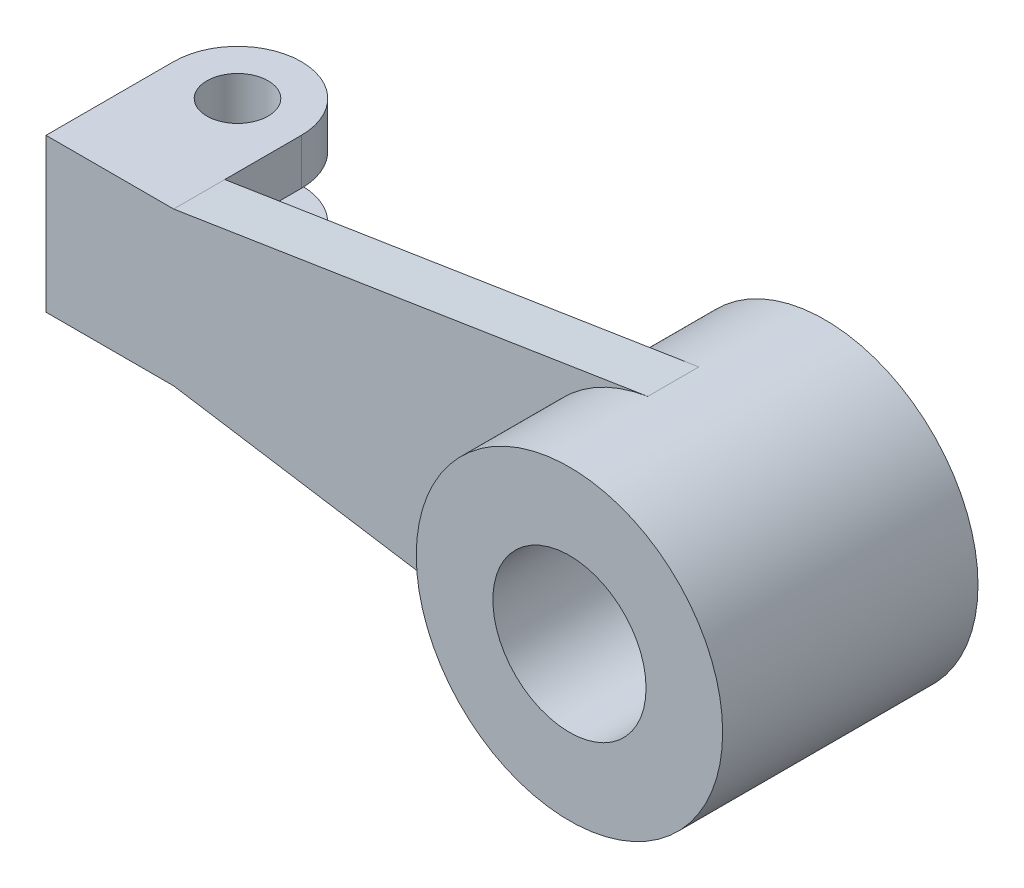
ISO-10303-21;
HEADER;
FILE_DESCRIPTION(('STEP AP214'),'2;1');
FILE_NAME('part.step','',(''),(''),'','','');
FILE_SCHEMA(('AUTOMOTIVE_DESIGN { 1 0 10303 214 1 1 1 1 }'));
ENDSEC;
DATA;
#1=APPLICATION_CONTEXT('core data for automotive mechanical design processes');
#2=APPLICATION_PROTOCOL_DEFINITION('international standard','automotive_design',2000,#1);
#3=PRODUCT_CONTEXT('',#1,'mechanical');
#4=PRODUCT('Part','Part','',(#3));
#5=PRODUCT_RELATED_PRODUCT_CATEGORY('part','',(#4));
#6=PRODUCT_DEFINITION_FORMATION('','',#4);
#7=PRODUCT_DEFINITION_CONTEXT('part definition',#1,'design');
#8=PRODUCT_DEFINITION('design','',#6,#7);
#9=PRODUCT_DEFINITION_SHAPE('','',#8);
#10=(LENGTH_UNIT() NAMED_UNIT(*) SI_UNIT(.MILLI.,.METRE.));
#11=(NAMED_UNIT(*) PLANE_ANGLE_UNIT() SI_UNIT($,.RADIAN.));
#12=(NAMED_UNIT(*) SI_UNIT($,.STERADIAN.) SOLID_ANGLE_UNIT());
#13=UNCERTAINTY_MEASURE_WITH_UNIT(LENGTH_MEASURE(1.E-05),#10,'distance_accuracy_value','');
#14=(GEOMETRIC_REPRESENTATION_CONTEXT(3) GLOBAL_UNCERTAINTY_ASSIGNED_CONTEXT((#13)) GLOBAL_UNIT_ASSIGNED_CONTEXT((#10,
#11,#12)) REPRESENTATION_CONTEXT('',''));
#15=CARTESIAN_POINT('',(0.,0.,0.));
#16=DIRECTION('',(0.,0.,1.));
#17=DIRECTION('',(1.,0.,0.));
#18=AXIS2_PLACEMENT_3D('',#15,#16,#17);
#19=CARTESIAN_POINT('',(0.,0.,-5.));
#20=DIRECTION('',(0.,0.,1.));
#21=DIRECTION('',(1.,0.,0.));
#22=AXIS2_PLACEMENT_3D('',#19,#20,#21);
#23=PLANE('',#22);
#24=DIRECTION('',(1.,0.,0.));
#25=VECTOR('',#24,1.);
#26=CARTESIAN_POINT('',(-97.5,-5.99999999999999,-5.));
#27=LINE('',#26,#25);
#28=CARTESIAN_POINT('',(-122.5,-6.,-5.));
#29=VERTEX_POINT('',#28);
#30=CARTESIAN_POINT('',(-97.5,-5.99999999999999,-5.));
#31=VERTEX_POINT('',#30);
#32=EDGE_CURVE('E115',#29,#31,#27,.T.);
#33=ORIENTED_EDGE('',*,*,#32,.F.);
#34=DIRECTION('',(0.,-1.,0.));
#35=VECTOR('',#34,1.);
#36=CARTESIAN_POINT('',(-122.5,15.,-5.));
#37=LINE('',#36,#35);
#38=CARTESIAN_POINT('',(-122.5,6.,-5.));
#39=VERTEX_POINT('',#38);
#40=EDGE_CURVE('E197',#39,#29,#37,.T.);
#41=ORIENTED_EDGE('',*,*,#40,.F.);
#42=DIRECTION('',(1.,0.,0.));
#43=VECTOR('',#42,1.);
#44=CARTESIAN_POINT('',(-97.5,5.99999999999999,-5.));
#45=LINE('',#44,#43);
#46=CARTESIAN_POINT('',(-97.5,5.99999999999999,-5.));
#47=VERTEX_POINT('',#46);
#48=EDGE_CURVE('E165',#39,#47,#45,.T.);
#49=ORIENTED_EDGE('',*,*,#48,.T.);
#50=DIRECTION('',(0.,1.,0.));
#51=VECTOR('',#50,1.);
#52=CARTESIAN_POINT('',(-97.5,5.99999999999999,-5.));
#53=LINE('',#52,#51);
#54=CARTESIAN_POINT('',(-97.5,15.,-5.));
#55=VERTEX_POINT('',#54);
#56=EDGE_CURVE('E173',#47,#55,#53,.T.);
#57=ORIENTED_EDGE('',*,*,#56,.T.);
#58=DIRECTION('',(-0.987800769478854,-0.155722958541715,0.));
#59=VECTOR('',#58,1.);
#60=CARTESIAN_POINT('',(-4.67168875625145,29.6340230843656,-5.));
#61=LINE('',#60,#59);
#62=CARTESIAN_POINT('',(-4.67168875625145,29.6340230843656,-5.));
#63=VERTEX_POINT('',#62);
#64=EDGE_CURVE('E194',#63,#55,#61,.T.);
#65=ORIENTED_EDGE('',*,*,#64,.F.);
#66=CARTESIAN_POINT('',(0.,0.,-5.));
#67=DIRECTION('',(0.,0.,-1.));
#68=DIRECTION('',(1.,0.,0.));
#69=AXIS2_PLACEMENT_3D('',#66,#67,#68);
#70=CIRCLE('',#69,30.);
#71=CARTESIAN_POINT('',(-4.67168875625145,-29.6340230843656,-5.));
#72=VERTEX_POINT('',#71);
#73=EDGE_CURVE('E176',#72,#63,#70,.T.);
#74=ORIENTED_EDGE('',*,*,#73,.F.);
#75=DIRECTION('',(0.987800769478854,-0.155722958541715,0.));
#76=VECTOR('',#75,1.);
#77=CARTESIAN_POINT('',(-4.67168875625145,-29.6340230843656,-5.));
#78=LINE('',#77,#76);
#79=CARTESIAN_POINT('',(-97.5,-15.,-5.));
#80=VERTEX_POINT('',#79);
#81=EDGE_CURVE('E140',#80,#72,#78,.T.);
#82=ORIENTED_EDGE('',*,*,#81,.F.);
#83=DIRECTION('',(0.,-1.,0.));
#84=VECTOR('',#83,1.);
#85=CARTESIAN_POINT('',(-97.5,-5.99999999999999,-5.));
#86=LINE('',#85,#84);
#87=EDGE_CURVE('E131',#31,#80,#86,.T.);
#88=ORIENTED_EDGE('',*,*,#87,.F.);
#89=EDGE_LOOP('',(#33,#41,#49,#57,#65,#74,#82,#88));
#90=FACE_BOUND('',#89,.T.);
#91=ADVANCED_FACE('F33',(#90),#23,.F.);
#92=CARTESIAN_POINT('',(0.,0.,25.));
#93=DIRECTION('',(0.,0.,1.));
#94=DIRECTION('',(1.,0.,0.));
#95=AXIS2_PLACEMENT_3D('',#92,#93,#94);
#96=PLANE('',#95);
#97=CARTESIAN_POINT('',(0.,0.,25.));
#98=DIRECTION('',(0.,0.,1.));
#99=DIRECTION('',(1.,0.,0.));
#100=AXIS2_PLACEMENT_3D('',#97,#98,#99);
#101=CIRCLE('',#100,30.);
#102=CARTESIAN_POINT('',(30.,0.,25.));
#103=VERTEX_POINT('',#102);
#104=EDGE_CURVE('E11',#103,#103,#101,.T.);
#105=ORIENTED_EDGE('',*,*,#104,.T.);
#106=EDGE_LOOP('',(#105));
#107=FACE_BOUND('',#106,.T.);
#108=CARTESIAN_POINT('',(0.,0.,25.));
#109=DIRECTION('',(0.,0.,1.));
#110=DIRECTION('',(1.,0.,0.));
#111=AXIS2_PLACEMENT_3D('',#108,#109,#110);
#112=CIRCLE('',#111,15.);
#113=CARTESIAN_POINT('',(15.,0.,25.));
#114=VERTEX_POINT('',#113);
#115=EDGE_CURVE('E213',#114,#114,#112,.T.);
#116=ORIENTED_EDGE('',*,*,#115,.F.);
#117=EDGE_LOOP('',(#116));
#118=FACE_BOUND('',#117,.T.);
#119=ADVANCED_FACE('F235',(#107,#118),#96,.T.);
#120=CARTESIAN_POINT('',(0.,0.,-25.));
#121=DIRECTION('',(0.,0.,1.));
#122=DIRECTION('',(1.,0.,0.));
#123=AXIS2_PLACEMENT_3D('',#120,#121,#122);
#124=PLANE('',#123);
#125=CARTESIAN_POINT('',(0.,0.,-25.));
#126=DIRECTION('',(0.,0.,1.));
#127=DIRECTION('',(1.,0.,0.));
#128=AXIS2_PLACEMENT_3D('',#125,#126,#127);
#129=CIRCLE('',#128,30.);
#130=CARTESIAN_POINT('',(30.,0.,-25.));
#131=VERTEX_POINT('',#130);
#132=EDGE_CURVE('E37',#131,#131,#129,.T.);
#133=ORIENTED_EDGE('',*,*,#132,.F.);
#134=EDGE_LOOP('',(#133));
#135=FACE_BOUND('',#134,.T.);
#136=CARTESIAN_POINT('',(0.,0.,-25.));
#137=DIRECTION('',(0.,0.,1.));
#138=DIRECTION('',(1.,0.,0.));
#139=AXIS2_PLACEMENT_3D('',#136,#137,#138);
#140=CIRCLE('',#139,15.);
#141=CARTESIAN_POINT('',(15.,0.,-25.));
#142=VERTEX_POINT('',#141);
#143=EDGE_CURVE('E212',#142,#142,#140,.T.);
#144=ORIENTED_EDGE('',*,*,#143,.T.);
#145=EDGE_LOOP('',(#144));
#146=FACE_BOUND('',#145,.T.);
#147=ADVANCED_FACE('F219',(#135,#146),#124,.F.);
#148=CARTESIAN_POINT('',(0.,0.,25.));
#149=DIRECTION('',(0.,0.,-1.));
#150=DIRECTION('',(-1.,0.,0.));
#151=AXIS2_PLACEMENT_3D('',#148,#149,#150);
#152=CYLINDRICAL_SURFACE('',#151,30.);
#153=DIRECTION('',(0.,0.,-1.));
#154=VECTOR('',#153,1.);
#155=CARTESIAN_POINT('',(-4.67168875625145,29.6340230843656,5.));
#156=LINE('',#155,#154);
#157=CARTESIAN_POINT('',(-4.67168875625145,29.6340230843656,5.));
#158=VERTEX_POINT('',#157);
#159=EDGE_CURVE('E48',#158,#63,#156,.T.);
#160=ORIENTED_EDGE('',*,*,#159,.F.);
#161=CARTESIAN_POINT('',(0.,0.,5.));
#162=DIRECTION('',(0.,0.,-1.));
#163=DIRECTION('',(1.,0.,0.));
#164=AXIS2_PLACEMENT_3D('',#161,#162,#163);
#165=CIRCLE('',#164,30.);
#166=CARTESIAN_POINT('',(-4.67168875625145,-29.6340230843656,5.));
#167=VERTEX_POINT('',#166);
#168=EDGE_CURVE('E53',#167,#158,#165,.T.);
#169=ORIENTED_EDGE('',*,*,#168,.F.);
#170=DIRECTION('',(0.,0.,-1.));
#171=VECTOR('',#170,1.);
#172=CARTESIAN_POINT('',(-4.67168875625145,-29.6340230843656,5.));
#173=LINE('',#172,#171);
#174=EDGE_CURVE('E192',#167,#72,#173,.T.);
#175=ORIENTED_EDGE('',*,*,#174,.T.);
#176=ORIENTED_EDGE('',*,*,#73,.T.);
#177=EDGE_LOOP('',(#160,#169,#175,#176));
#178=FACE_BOUND('',#177,.T.);
#179=ORIENTED_EDGE('',*,*,#104,.F.);
#180=EDGE_LOOP('',(#179));
#181=FACE_BOUND('',#180,.T.);
#182=ORIENTED_EDGE('',*,*,#132,.T.);
#183=EDGE_LOOP('',(#182));
#184=FACE_BOUND('',#183,.T.);
#185=ADVANCED_FACE('F35',(#178,#181,#184),#152,.T.);
#186=CARTESIAN_POINT('',(0.,0.,25.));
#187=DIRECTION('',(0.,0.,-1.));
#188=DIRECTION('',(-1.,0.,0.));
#189=AXIS2_PLACEMENT_3D('',#186,#187,#188);
#190=CYLINDRICAL_SURFACE('',#189,15.);
#191=ORIENTED_EDGE('',*,*,#115,.T.);
#192=EDGE_LOOP('',(#191));
#193=FACE_BOUND('',#192,.T.);
#194=ORIENTED_EDGE('',*,*,#143,.F.);
#195=EDGE_LOOP('',(#194));
#196=FACE_BOUND('',#195,.T.);
#197=ADVANCED_FACE('F221',(#193,#196),#190,.F.);
#198=CARTESIAN_POINT('',(-4.67168875625145,29.6340230843656,5.));
#199=DIRECTION('',(0.155722958541715,-0.987800769478854,0.));
#200=DIRECTION('',(0.987800769478854,0.155722958541715,0.));
#201=AXIS2_PLACEMENT_3D('',#198,#199,#200);
#202=PLANE('',#201);
#203=ORIENTED_EDGE('',*,*,#64,.T.);
#204=DIRECTION('',(0.,0.,-1.));
#205=VECTOR('',#204,1.);
#206=CARTESIAN_POINT('',(-97.5,15.,5.));
#207=LINE('',#206,#205);
#208=CARTESIAN_POINT('',(-97.5,15.,5.));
#209=VERTEX_POINT('',#208);
#210=EDGE_CURVE('E208',#209,#55,#207,.T.);
#211=ORIENTED_EDGE('',*,*,#210,.F.);
#212=DIRECTION('',(-0.987800769478854,-0.155722958541715,0.));
#213=VECTOR('',#212,1.);
#214=CARTESIAN_POINT('',(-4.67168875625145,29.6340230843656,5.));
#215=LINE('',#214,#213);
#216=EDGE_CURVE('E182',#158,#209,#215,.T.);
#217=ORIENTED_EDGE('',*,*,#216,.F.);
#218=ORIENTED_EDGE('',*,*,#159,.T.);
#219=EDGE_LOOP('',(#203,#211,#217,#218));
#220=FACE_BOUND('',#219,.T.);
#221=ADVANCED_FACE('F223',(#220),#202,.F.);
#222=CARTESIAN_POINT('',(-97.5,15.,5.));
#223=DIRECTION('',(0.,-1.,0.));
#224=DIRECTION('',(1.,0.,0.));
#225=AXIS2_PLACEMENT_3D('',#222,#223,#224);
#226=PLANE('',#225);
#227=ORIENTED_EDGE('',*,*,#210,.T.);
#228=DIRECTION('',(0.,0.,-1.));
#229=VECTOR('',#228,1.);
#230=CARTESIAN_POINT('',(-97.5,15.,-20.));
#231=LINE('',#230,#229);
#232=CARTESIAN_POINT('',(-97.5,15.,-20.));
#233=VERTEX_POINT('',#232);
#234=EDGE_CURVE('E152',#55,#233,#231,.T.);
#235=ORIENTED_EDGE('',*,*,#234,.T.);
#236=CARTESIAN_POINT('',(-110.,15.,-20.));
#237=DIRECTION('',(0.,1.,0.));
#238=DIRECTION('',(-1.,0.,0.));
#239=AXIS2_PLACEMENT_3D('',#236,#237,#238);
#240=CIRCLE('',#239,12.5);
#241=CARTESIAN_POINT('',(-122.5,15.,-20.));
#242=VERTEX_POINT('',#241);
#243=EDGE_CURVE('E160',#233,#242,#240,.T.);
#244=ORIENTED_EDGE('',*,*,#243,.T.);
#245=DIRECTION('',(0.,0.,-1.));
#246=VECTOR('',#245,1.);
#247=CARTESIAN_POINT('',(-122.5,15.,5.));
#248=LINE('',#247,#246);
#249=CARTESIAN_POINT('',(-122.5,15.,5.));
#250=VERTEX_POINT('',#249);
#251=EDGE_CURVE('E206',#250,#242,#248,.T.);
#252=ORIENTED_EDGE('',*,*,#251,.F.);
#253=DIRECTION('',(-1.,0.,0.));
#254=VECTOR('',#253,1.);
#255=CARTESIAN_POINT('',(-97.5,15.,5.));
#256=LINE('',#255,#254);
#257=EDGE_CURVE('E184',#209,#250,#256,.T.);
#258=ORIENTED_EDGE('',*,*,#257,.F.);
#259=EDGE_LOOP('',(#227,#235,#244,#252,#258));
#260=FACE_BOUND('',#259,.T.);
#261=CARTESIAN_POINT('',(-110.,15.,-20.));
#262=DIRECTION('',(0.,1.,0.));
#263=DIRECTION('',(-1.,0.,0.));
#264=AXIS2_PLACEMENT_3D('',#261,#262,#263);
#265=CIRCLE('',#264,6.);
#266=CARTESIAN_POINT('',(-116.,15.,-20.));
#267=VERTEX_POINT('',#266);
#268=EDGE_CURVE('E153',#267,#267,#265,.T.);
#269=ORIENTED_EDGE('',*,*,#268,.F.);
#270=EDGE_LOOP('',(#269));
#271=FACE_BOUND('',#270,.T.);
#272=ADVANCED_FACE('F230',(#260,#271),#226,.F.);
#273=CARTESIAN_POINT('',(-122.5,15.,5.));
#274=DIRECTION('',(1.,0.,0.));
#275=DIRECTION('',(0.,0.,-1.));
#276=AXIS2_PLACEMENT_3D('',#273,#274,#275);
#277=PLANE('',#276);
#278=ORIENTED_EDGE('',*,*,#251,.T.);
#279=DIRECTION('',(0.,1.,0.));
#280=VECTOR('',#279,1.);
#281=CARTESIAN_POINT('',(-122.5,6.,-20.));
#282=LINE('',#281,#280);
#283=CARTESIAN_POINT('',(-122.5,6.,-20.));
#284=VERTEX_POINT('',#283);
#285=EDGE_CURVE('E177',#284,#242,#282,.T.);
#286=ORIENTED_EDGE('',*,*,#285,.F.);
#287=DIRECTION('',(0.,0.,1.));
#288=VECTOR('',#287,1.);
#289=CARTESIAN_POINT('',(-122.5,6.,-5.));
#290=LINE('',#289,#288);
#291=EDGE_CURVE('E163',#284,#39,#290,.T.);
#292=ORIENTED_EDGE('',*,*,#291,.T.);
#293=ORIENTED_EDGE('',*,*,#40,.T.);
#294=DIRECTION('',(0.,0.,1.));
#295=VECTOR('',#294,1.);
#296=CARTESIAN_POINT('',(-122.5,-6.,-5.));
#297=LINE('',#296,#295);
#298=CARTESIAN_POINT('',(-122.5,-6.,-20.));
#299=VERTEX_POINT('',#298);
#300=EDGE_CURVE('E122',#299,#29,#297,.T.);
#301=ORIENTED_EDGE('',*,*,#300,.F.);
#302=DIRECTION('',(0.,-1.,0.));
#303=VECTOR('',#302,1.);
#304=CARTESIAN_POINT('',(-122.5,-6.,-20.));
#305=LINE('',#304,#303);
#306=CARTESIAN_POINT('',(-122.5,-15.,-20.));
#307=VERTEX_POINT('',#306);
#308=EDGE_CURVE('E141',#299,#307,#305,.T.);
#309=ORIENTED_EDGE('',*,*,#308,.T.);
#310=DIRECTION('',(0.,0.,-1.));
#311=VECTOR('',#310,1.);
#312=CARTESIAN_POINT('',(-122.5,-15.,5.));
#313=LINE('',#312,#311);
#314=CARTESIAN_POINT('',(-122.5,-15.,5.));
#315=VERTEX_POINT('',#314);
#316=EDGE_CURVE('E204',#315,#307,#313,.T.);
#317=ORIENTED_EDGE('',*,*,#316,.F.);
#318=DIRECTION('',(0.,-1.,0.));
#319=VECTOR('',#318,1.);
#320=CARTESIAN_POINT('',(-122.5,15.,5.));
#321=LINE('',#320,#319);
#322=EDGE_CURVE('E186',#250,#315,#321,.T.);
#323=ORIENTED_EDGE('',*,*,#322,.F.);
#324=EDGE_LOOP('',(#278,#286,#292,#293,#301,#309,#317,#323));
#325=FACE_BOUND('',#324,.T.);
#326=ADVANCED_FACE('F252',(#325),#277,.F.);
#327=CARTESIAN_POINT('',(-97.5,-15.,5.));
#328=DIRECTION('',(0.,1.,0.));
#329=DIRECTION('',(-1.,0.,0.));
#330=AXIS2_PLACEMENT_3D('',#327,#328,#329);
#331=PLANE('',#330);
#332=ORIENTED_EDGE('',*,*,#316,.T.);
#333=CARTESIAN_POINT('',(-110.,-15.,-20.));
#334=DIRECTION('',(0.,1.,0.));
#335=DIRECTION('',(-1.,0.,0.));
#336=AXIS2_PLACEMENT_3D('',#333,#334,#335);
#337=CIRCLE('',#336,12.5);
#338=CARTESIAN_POINT('',(-97.5,-15.,-20.));
#339=VERTEX_POINT('',#338);
#340=EDGE_CURVE('E135',#339,#307,#337,.T.);
#341=ORIENTED_EDGE('',*,*,#340,.F.);
#342=DIRECTION('',(0.,0.,-1.));
#343=VECTOR('',#342,1.);
#344=CARTESIAN_POINT('',(-97.5,-15.,-20.));
#345=LINE('',#344,#343);
#346=EDGE_CURVE('E423',#80,#339,#345,.T.);
#347=ORIENTED_EDGE('',*,*,#346,.F.);
#348=DIRECTION('',(0.,0.,-1.));
#349=VECTOR('',#348,1.);
#350=CARTESIAN_POINT('',(-97.5,-15.,5.));
#351=LINE('',#350,#349);
#352=CARTESIAN_POINT('',(-97.5,-15.,5.));
#353=VERTEX_POINT('',#352);
#354=EDGE_CURVE('E201',#353,#80,#351,.T.);
#355=ORIENTED_EDGE('',*,*,#354,.F.);
#356=DIRECTION('',(1.,0.,0.));
#357=VECTOR('',#356,1.);
#358=CARTESIAN_POINT('',(-97.5,-15.,5.));
#359=LINE('',#358,#357);
#360=EDGE_CURVE('E188',#315,#353,#359,.T.);
#361=ORIENTED_EDGE('',*,*,#360,.F.);
#362=EDGE_LOOP('',(#332,#341,#347,#355,#361));
#363=FACE_BOUND('',#362,.T.);
#364=CARTESIAN_POINT('',(-110.,-15.,-20.));
#365=DIRECTION('',(0.,1.,0.));
#366=DIRECTION('',(-1.,0.,0.));
#367=AXIS2_PLACEMENT_3D('',#364,#365,#366);
#368=CIRCLE('',#367,6.);
#369=CARTESIAN_POINT('',(-116.,-15.,-20.));
#370=VERTEX_POINT('',#369);
#371=EDGE_CURVE('E420',#370,#370,#368,.T.);
#372=ORIENTED_EDGE('',*,*,#371,.T.);
#373=EDGE_LOOP('',(#372));
#374=FACE_BOUND('',#373,.T.);
#375=ADVANCED_FACE('F248',(#363,#374),#331,.F.);
#376=CARTESIAN_POINT('',(-4.67168875625145,-29.6340230843656,5.));
#377=DIRECTION('',(0.155722958541715,0.987800769478854,0.));
#378=DIRECTION('',(-0.987800769478854,0.155722958541715,0.));
#379=AXIS2_PLACEMENT_3D('',#376,#377,#378);
#380=PLANE('',#379);
#381=ORIENTED_EDGE('',*,*,#81,.T.);
#382=ORIENTED_EDGE('',*,*,#174,.F.);
#383=DIRECTION('',(0.987800769478854,-0.155722958541715,0.));
#384=VECTOR('',#383,1.);
#385=CARTESIAN_POINT('',(-4.67168875625145,-29.6340230843656,5.));
#386=LINE('',#385,#384);
#387=EDGE_CURVE('E190',#353,#167,#386,.T.);
#388=ORIENTED_EDGE('',*,*,#387,.F.);
#389=ORIENTED_EDGE('',*,*,#354,.T.);
#390=EDGE_LOOP('',(#381,#382,#388,#389));
#391=FACE_BOUND('',#390,.T.);
#392=ADVANCED_FACE('F245',(#391),#380,.F.);
#393=CARTESIAN_POINT('',(0.,0.,5.));
#394=DIRECTION('',(0.,0.,1.));
#395=DIRECTION('',(1.,0.,0.));
#396=AXIS2_PLACEMENT_3D('',#393,#394,#395);
#397=PLANE('',#396);
#398=ORIENTED_EDGE('',*,*,#168,.T.);
#399=ORIENTED_EDGE('',*,*,#216,.T.);
#400=ORIENTED_EDGE('',*,*,#257,.T.);
#401=ORIENTED_EDGE('',*,*,#322,.T.);
#402=ORIENTED_EDGE('',*,*,#360,.T.);
#403=ORIENTED_EDGE('',*,*,#387,.T.);
#404=EDGE_LOOP('',(#398,#399,#400,#401,#402,#403));
#405=FACE_BOUND('',#404,.T.);
#406=ADVANCED_FACE('F243',(#405),#397,.T.);
#407=CARTESIAN_POINT('',(-97.5,5.99999999999999,-20.));
#408=DIRECTION('',(1.,0.,0.));
#409=DIRECTION('',(0.,0.,-1.));
#410=AXIS2_PLACEMENT_3D('',#407,#408,#409);
#411=PLANE('',#410);
#412=ORIENTED_EDGE('',*,*,#234,.F.);
#413=ORIENTED_EDGE('',*,*,#56,.F.);
#414=DIRECTION('',(0.,0.,-1.));
#415=VECTOR('',#414,1.);
#416=CARTESIAN_POINT('',(-97.5,5.99999999999999,-20.));
#417=LINE('',#416,#415);
#418=CARTESIAN_POINT('',(-97.5,5.99999999999999,-20.));
#419=VERTEX_POINT('',#418);
#420=EDGE_CURVE('E156',#47,#419,#417,.T.);
#421=ORIENTED_EDGE('',*,*,#420,.T.);
#422=DIRECTION('',(0.,1.,0.));
#423=VECTOR('',#422,1.);
#424=CARTESIAN_POINT('',(-97.5,5.99999999999999,-20.));
#425=LINE('',#424,#423);
#426=EDGE_CURVE('E168',#419,#233,#425,.T.);
#427=ORIENTED_EDGE('',*,*,#426,.T.);
#428=EDGE_LOOP('',(#412,#413,#421,#427));
#429=FACE_BOUND('',#428,.T.);
#430=ADVANCED_FACE('F284',(#429),#411,.T.);
#431=CARTESIAN_POINT('',(-110.,6.,-20.));
#432=DIRECTION('',(0.,1.,0.));
#433=DIRECTION('',(-1.,0.,0.));
#434=AXIS2_PLACEMENT_3D('',#431,#432,#433);
#435=CYLINDRICAL_SURFACE('',#434,12.5);
#436=ORIENTED_EDGE('',*,*,#243,.F.);
#437=ORIENTED_EDGE('',*,*,#426,.F.);
#438=CARTESIAN_POINT('',(-110.,6.,-20.));
#439=DIRECTION('',(0.,1.,0.));
#440=DIRECTION('',(-1.,0.,0.));
#441=AXIS2_PLACEMENT_3D('',#438,#439,#440);
#442=CIRCLE('',#441,12.5);
#443=EDGE_CURVE('E159',#419,#284,#442,.T.);
#444=ORIENTED_EDGE('',*,*,#443,.T.);
#445=ORIENTED_EDGE('',*,*,#285,.T.);
#446=EDGE_LOOP('',(#436,#437,#444,#445));
#447=FACE_BOUND('',#446,.T.);
#448=ADVANCED_FACE('F276',(#447),#435,.T.);
#449=CARTESIAN_POINT('',(-110.,6.,-20.));
#450=DIRECTION('',(0.,1.,0.));
#451=DIRECTION('',(-1.,0.,0.));
#452=AXIS2_PLACEMENT_3D('',#449,#450,#451);
#453=PLANE('',#452);
#454=CARTESIAN_POINT('',(-110.,6.,-20.));
#455=DIRECTION('',(0.,1.,0.));
#456=DIRECTION('',(-1.,0.,0.));
#457=AXIS2_PLACEMENT_3D('',#454,#455,#456);
#458=CIRCLE('',#457,6.);
#459=CARTESIAN_POINT('',(-116.,6.,-20.));
#460=VERTEX_POINT('',#459);
#461=EDGE_CURVE('E149',#460,#460,#458,.T.);
#462=ORIENTED_EDGE('',*,*,#461,.T.);
#463=EDGE_LOOP('',(#462));
#464=FACE_BOUND('',#463,.T.);
#465=ORIENTED_EDGE('',*,*,#420,.F.);
#466=ORIENTED_EDGE('',*,*,#48,.F.);
#467=ORIENTED_EDGE('',*,*,#291,.F.);
#468=ORIENTED_EDGE('',*,*,#443,.F.);
#469=EDGE_LOOP('',(#465,#466,#467,#468));
#470=FACE_BOUND('',#469,.T.);
#471=ADVANCED_FACE('F268',(#464,#470),#453,.F.);
#472=CARTESIAN_POINT('',(-110.,6.,-20.));
#473=DIRECTION('',(0.,1.,0.));
#474=DIRECTION('',(-1.,0.,0.));
#475=AXIS2_PLACEMENT_3D('',#472,#473,#474);
#476=CYLINDRICAL_SURFACE('',#475,6.);
#477=ORIENTED_EDGE('',*,*,#461,.F.);
#478=EDGE_LOOP('',(#477));
#479=FACE_BOUND('',#478,.T.);
#480=ORIENTED_EDGE('',*,*,#268,.T.);
#481=EDGE_LOOP('',(#480));
#482=FACE_BOUND('',#481,.T.);
#483=ADVANCED_FACE('F266',(#479,#482),#476,.F.);
#484=CARTESIAN_POINT('',(-110.,-6.,-20.));
#485=DIRECTION('',(0.,-1.,0.));
#486=DIRECTION('',(-1.,0.,0.));
#487=AXIS2_PLACEMENT_3D('',#484,#485,#486);
#488=PLANE('',#487);
#489=DIRECTION('',(0.,0.,-1.));
#490=VECTOR('',#489,1.);
#491=CARTESIAN_POINT('',(-97.5,-5.99999999999999,-20.));
#492=LINE('',#491,#490);
#493=CARTESIAN_POINT('',(-97.5,-5.99999999999999,-20.));
#494=VERTEX_POINT('',#493);
#495=EDGE_CURVE('E119',#31,#494,#492,.T.);
#496=ORIENTED_EDGE('',*,*,#495,.T.);
#497=CARTESIAN_POINT('',(-110.,-6.,-20.));
#498=DIRECTION('',(0.,1.,0.));
#499=DIRECTION('',(-1.,0.,0.));
#500=AXIS2_PLACEMENT_3D('',#497,#498,#499);
#501=CIRCLE('',#500,12.5);
#502=EDGE_CURVE('E142',#494,#299,#501,.T.);
#503=ORIENTED_EDGE('',*,*,#502,.T.);
#504=ORIENTED_EDGE('',*,*,#300,.T.);
#505=ORIENTED_EDGE('',*,*,#32,.T.);
#506=EDGE_LOOP('',(#496,#503,#504,#505));
#507=FACE_BOUND('',#506,.T.);
#508=CARTESIAN_POINT('',(-110.,-6.,-20.));
#509=DIRECTION('',(0.,1.,0.));
#510=DIRECTION('',(-1.,0.,0.));
#511=AXIS2_PLACEMENT_3D('',#508,#509,#510);
#512=CIRCLE('',#511,6.);
#513=CARTESIAN_POINT('',(-116.,-6.,-20.));
#514=VERTEX_POINT('',#513);
#515=EDGE_CURVE('E417',#514,#514,#512,.T.);
#516=ORIENTED_EDGE('',*,*,#515,.F.);
#517=EDGE_LOOP('',(#516));
#518=FACE_BOUND('',#517,.T.);
#519=ADVANCED_FACE('F117',(#507,#518),#488,.F.);
#520=CARTESIAN_POINT('',(-97.5,-5.99999999999999,-20.));
#521=DIRECTION('',(-1.,0.,0.));
#522=DIRECTION('',(0.,0.,1.));
#523=AXIS2_PLACEMENT_3D('',#520,#521,#522);
#524=PLANE('',#523);
#525=ORIENTED_EDGE('',*,*,#346,.T.);
#526=DIRECTION('',(0.,-1.,0.));
#527=VECTOR('',#526,1.);
#528=CARTESIAN_POINT('',(-97.5,-5.99999999999999,-20.));
#529=LINE('',#528,#527);
#530=EDGE_CURVE('E134',#494,#339,#529,.T.);
#531=ORIENTED_EDGE('',*,*,#530,.F.);
#532=ORIENTED_EDGE('',*,*,#495,.F.);
#533=ORIENTED_EDGE('',*,*,#87,.T.);
#534=EDGE_LOOP('',(#525,#531,#532,#533));
#535=FACE_BOUND('',#534,.T.);
#536=ADVANCED_FACE('F130',(#535),#524,.F.);
#537=CARTESIAN_POINT('',(-110.,-6.,-20.));
#538=DIRECTION('',(0.,-1.,0.));
#539=DIRECTION('',(1.,0.,0.));
#540=AXIS2_PLACEMENT_3D('',#537,#538,#539);
#541=CYLINDRICAL_SURFACE('',#540,12.5);
#542=ORIENTED_EDGE('',*,*,#340,.T.);
#543=ORIENTED_EDGE('',*,*,#308,.F.);
#544=ORIENTED_EDGE('',*,*,#502,.F.);
#545=ORIENTED_EDGE('',*,*,#530,.T.);
#546=EDGE_LOOP('',(#542,#543,#544,#545));
#547=FACE_BOUND('',#546,.T.);
#548=ADVANCED_FACE('F393',(#547),#541,.T.);
#549=CARTESIAN_POINT('',(-110.,-6.,-20.));
#550=DIRECTION('',(0.,-1.,0.));
#551=DIRECTION('',(1.,0.,0.));
#552=AXIS2_PLACEMENT_3D('',#549,#550,#551);
#553=CYLINDRICAL_SURFACE('',#552,6.);
#554=ORIENTED_EDGE('',*,*,#515,.T.);
#555=EDGE_LOOP('',(#554));
#556=FACE_BOUND('',#555,.T.);
#557=ORIENTED_EDGE('',*,*,#371,.F.);
#558=EDGE_LOOP('',(#557));
#559=FACE_BOUND('',#558,.T.);
#560=ADVANCED_FACE('F401',(#556,#559),#553,.F.);
#561=CLOSED_SHELL('',(#91,#119,#147,#185,#197,#221,#272,#326,#375,#392,#406,#430,#448,#471,#483,
#519,#536,#548,#560));
#562=MANIFOLD_SOLID_BREP('B2',#561);
#563=ADVANCED_BREP_SHAPE_REPRESENTATION('',(#18,#562),#14);
#564=SHAPE_DEFINITION_REPRESENTATION(#9,#563);
ENDSEC;
END-ISO-10303-21;
